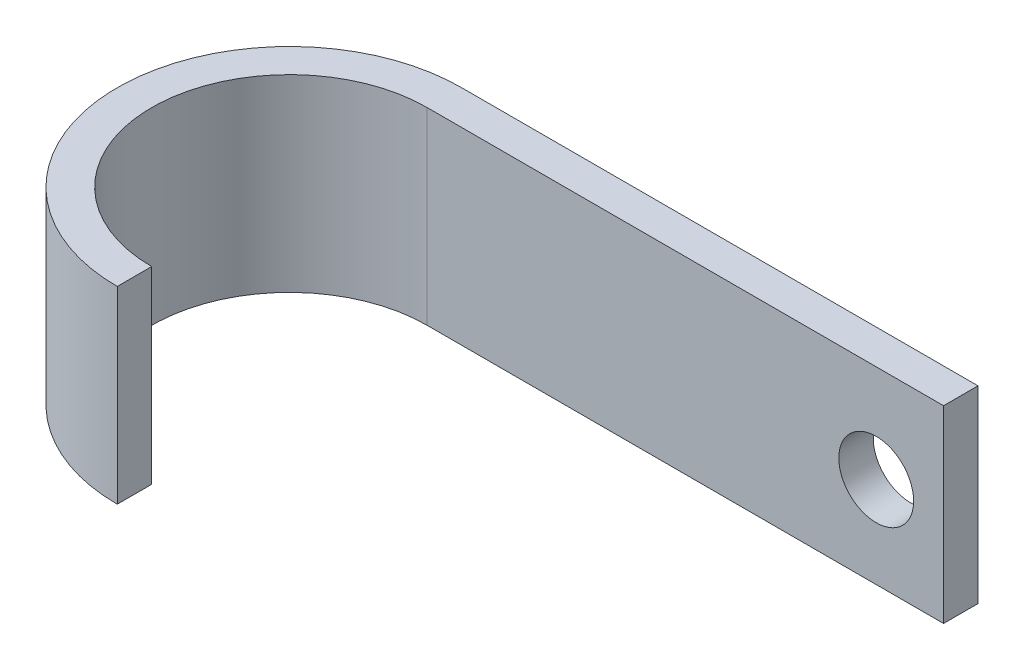
ISO-10303-21;
HEADER;
FILE_DESCRIPTION(('STEP AP214'),'2;1');
FILE_NAME('part.step','',(''),(''),'','','');
FILE_SCHEMA(('AUTOMOTIVE_DESIGN { 1 0 10303 214 1 1 1 1 }'));
ENDSEC;
DATA;
#1=APPLICATION_CONTEXT('core data for automotive mechanical design processes');
#2=APPLICATION_PROTOCOL_DEFINITION('international standard','automotive_design',2000,#1);
#3=PRODUCT_CONTEXT('',#1,'mechanical');
#4=PRODUCT('Part','Part','',(#3));
#5=PRODUCT_RELATED_PRODUCT_CATEGORY('part','',(#4));
#6=PRODUCT_DEFINITION_FORMATION('','',#4);
#7=PRODUCT_DEFINITION_CONTEXT('part definition',#1,'design');
#8=PRODUCT_DEFINITION('design','',#6,#7);
#9=PRODUCT_DEFINITION_SHAPE('','',#8);
#10=(LENGTH_UNIT() NAMED_UNIT(*) SI_UNIT(.MILLI.,.METRE.));
#11=(NAMED_UNIT(*) PLANE_ANGLE_UNIT() SI_UNIT($,.RADIAN.));
#12=(NAMED_UNIT(*) SI_UNIT($,.STERADIAN.) SOLID_ANGLE_UNIT());
#13=UNCERTAINTY_MEASURE_WITH_UNIT(LENGTH_MEASURE(1.E-05),#10,'distance_accuracy_value','');
#14=(GEOMETRIC_REPRESENTATION_CONTEXT(3) GLOBAL_UNCERTAINTY_ASSIGNED_CONTEXT((#13)) GLOBAL_UNIT_ASSIGNED_CONTEXT((#10,
#11,#12)) REPRESENTATION_CONTEXT('',''));
#15=CARTESIAN_POINT('',(0.,0.,0.));
#16=DIRECTION('',(0.,0.,1.));
#17=DIRECTION('',(1.,0.,0.));
#18=AXIS2_PLACEMENT_3D('',#15,#16,#17);
#19=CARTESIAN_POINT('',(0.,12.6,0.));
#20=DIRECTION('',(0.,-1.,0.));
#21=DIRECTION('',(0.,0.,-1.));
#22=AXIS2_PLACEMENT_3D('',#19,#20,#21);
#23=CYLINDRICAL_SURFACE('',#22,11.5);
#24=CARTESIAN_POINT('',(0.,0.,0.));
#25=DIRECTION('',(0.,1.,0.));
#26=DIRECTION('',(0.,0.,1.));
#27=AXIS2_PLACEMENT_3D('',#24,#25,#26);
#28=CIRCLE('',#27,11.5);
#29=CARTESIAN_POINT('',(0.,0.,-11.5));
#30=VERTEX_POINT('',#29);
#31=CARTESIAN_POINT('',(0.,0.,11.5));
#32=VERTEX_POINT('',#31);
#33=EDGE_CURVE('E119',#30,#32,#28,.T.);
#34=ORIENTED_EDGE('',*,*,#33,.T.);
#35=DIRECTION('',(0.,-1.,0.));
#36=VECTOR('',#35,1.);
#37=CARTESIAN_POINT('',(0.,12.6,11.5));
#38=LINE('',#37,#36);
#39=CARTESIAN_POINT('',(0.,12.6,11.5));
#40=VERTEX_POINT('',#39);
#41=EDGE_CURVE('E11',#40,#32,#38,.T.);
#42=ORIENTED_EDGE('',*,*,#41,.F.);
#43=CARTESIAN_POINT('',(0.,12.6,0.));
#44=DIRECTION('',(0.,1.,0.));
#45=DIRECTION('',(0.,0.,1.));
#46=AXIS2_PLACEMENT_3D('',#43,#44,#45);
#47=CIRCLE('',#46,11.5);
#48=CARTESIAN_POINT('',(0.,12.6,-11.5));
#49=VERTEX_POINT('',#48);
#50=EDGE_CURVE('E130',#49,#40,#47,.T.);
#51=ORIENTED_EDGE('',*,*,#50,.F.);
#52=DIRECTION('',(0.,-1.,0.));
#53=VECTOR('',#52,1.);
#54=CARTESIAN_POINT('',(0.,12.6,-11.5));
#55=LINE('',#54,#53);
#56=EDGE_CURVE('E115',#49,#30,#55,.T.);
#57=ORIENTED_EDGE('',*,*,#56,.T.);
#58=EDGE_LOOP('',(#34,#42,#51,#57));
#59=FACE_BOUND('',#58,.T.);
#60=ADVANCED_FACE('F33',(#59),#23,.T.);
#61=CARTESIAN_POINT('',(0.,12.6,11.5));
#62=DIRECTION('',(-1.,0.,0.));
#63=DIRECTION('',(0.,0.,1.));
#64=AXIS2_PLACEMENT_3D('',#61,#62,#63);
#65=PLANE('',#64);
#66=DIRECTION('',(0.,0.,-1.));
#67=VECTOR('',#66,1.);
#68=CARTESIAN_POINT('',(0.,0.,11.5));
#69=LINE('',#68,#67);
#70=CARTESIAN_POINT('',(0.,0.,9.2));
#71=VERTEX_POINT('',#70);
#72=EDGE_CURVE('E122',#32,#71,#69,.T.);
#73=ORIENTED_EDGE('',*,*,#72,.T.);
#74=DIRECTION('',(0.,-1.,0.));
#75=VECTOR('',#74,1.);
#76=CARTESIAN_POINT('',(0.,12.6,9.2));
#77=LINE('',#76,#75);
#78=CARTESIAN_POINT('',(0.,12.6,9.2));
#79=VERTEX_POINT('',#78);
#80=EDGE_CURVE('E42',#79,#71,#77,.T.);
#81=ORIENTED_EDGE('',*,*,#80,.F.);
#82=DIRECTION('',(0.,0.,-1.));
#83=VECTOR('',#82,1.);
#84=CARTESIAN_POINT('',(0.,12.6,11.5));
#85=LINE('',#84,#83);
#86=EDGE_CURVE('E85',#40,#79,#85,.T.);
#87=ORIENTED_EDGE('',*,*,#86,.F.);
#88=ORIENTED_EDGE('',*,*,#41,.T.);
#89=EDGE_LOOP('',(#73,#81,#87,#88));
#90=FACE_BOUND('',#89,.T.);
#91=ADVANCED_FACE('F163',(#90),#65,.F.);
#92=CARTESIAN_POINT('',(0.,12.6,0.));
#93=DIRECTION('',(0.,-1.,0.));
#94=DIRECTION('',(0.,0.,-1.));
#95=AXIS2_PLACEMENT_3D('',#92,#93,#94);
#96=CYLINDRICAL_SURFACE('',#95,9.2);
#97=CARTESIAN_POINT('',(0.,0.,0.));
#98=DIRECTION('',(0.,-1.,0.));
#99=DIRECTION('',(0.,0.,-1.));
#100=AXIS2_PLACEMENT_3D('',#97,#98,#99);
#101=CIRCLE('',#100,9.2);
#102=CARTESIAN_POINT('',(0.,0.,-9.19999999999999));
#103=VERTEX_POINT('',#102);
#104=EDGE_CURVE('E124',#71,#103,#101,.T.);
#105=ORIENTED_EDGE('',*,*,#104,.T.);
#106=DIRECTION('',(0.,-1.,0.));
#107=VECTOR('',#106,1.);
#108=CARTESIAN_POINT('',(0.,12.6,-9.19999999999999));
#109=LINE('',#108,#107);
#110=CARTESIAN_POINT('',(0.,12.6,-9.19999999999999));
#111=VERTEX_POINT('',#110);
#112=EDGE_CURVE('E110',#111,#103,#109,.T.);
#113=ORIENTED_EDGE('',*,*,#112,.F.);
#114=CARTESIAN_POINT('',(0.,12.6,0.));
#115=DIRECTION('',(0.,-1.,0.));
#116=DIRECTION('',(0.,0.,-1.));
#117=AXIS2_PLACEMENT_3D('',#114,#115,#116);
#118=CIRCLE('',#117,9.2);
#119=EDGE_CURVE('E99',#79,#111,#118,.T.);
#120=ORIENTED_EDGE('',*,*,#119,.F.);
#121=ORIENTED_EDGE('',*,*,#80,.T.);
#122=EDGE_LOOP('',(#105,#113,#120,#121));
#123=FACE_BOUND('',#122,.T.);
#124=ADVANCED_FACE('F137',(#123),#96,.F.);
#125=CARTESIAN_POINT('',(34.5,12.6,-9.2));
#126=DIRECTION('',(0.,0.,-1.));
#127=DIRECTION('',(-1.,0.,0.));
#128=AXIS2_PLACEMENT_3D('',#125,#126,#127);
#129=PLANE('',#128);
#130=CARTESIAN_POINT('',(30.,6.07998962858584,-9.19999999999999));
#131=DIRECTION('',(0.,0.,1.));
#132=DIRECTION('',(1.,0.,0.));
#133=AXIS2_PLACEMENT_3D('',#130,#131,#132);
#134=CIRCLE('',#133,2.5);
#135=CARTESIAN_POINT('',(32.5,6.07998962858584,-9.19999999999999));
#136=VERTEX_POINT('',#135);
#137=EDGE_CURVE('E146',#136,#136,#134,.T.);
#138=ORIENTED_EDGE('',*,*,#137,.F.);
#139=EDGE_LOOP('',(#138));
#140=FACE_BOUND('',#139,.T.);
#141=DIRECTION('',(1.,0.,0.));
#142=VECTOR('',#141,1.);
#143=CARTESIAN_POINT('',(34.5,0.,-9.2));
#144=LINE('',#143,#142);
#145=CARTESIAN_POINT('',(34.5,0.,-9.2));
#146=VERTEX_POINT('',#145);
#147=EDGE_CURVE('E108',#103,#146,#144,.T.);
#148=ORIENTED_EDGE('',*,*,#147,.T.);
#149=DIRECTION('',(0.,-1.,0.));
#150=VECTOR('',#149,1.);
#151=CARTESIAN_POINT('',(34.5,12.6,-9.2));
#152=LINE('',#151,#150);
#153=CARTESIAN_POINT('',(34.5,12.6,-9.2));
#154=VERTEX_POINT('',#153);
#155=EDGE_CURVE('E105',#154,#146,#152,.T.);
#156=ORIENTED_EDGE('',*,*,#155,.F.);
#157=DIRECTION('',(1.,0.,0.));
#158=VECTOR('',#157,1.);
#159=CARTESIAN_POINT('',(34.5,12.6,-9.2));
#160=LINE('',#159,#158);
#161=EDGE_CURVE('E92',#111,#154,#160,.T.);
#162=ORIENTED_EDGE('',*,*,#161,.F.);
#163=ORIENTED_EDGE('',*,*,#112,.T.);
#164=EDGE_LOOP('',(#148,#156,#162,#163));
#165=FACE_BOUND('',#164,.T.);
#166=ADVANCED_FACE('F106',(#140,#165),#129,.F.);
#167=CARTESIAN_POINT('',(34.5,12.6,-11.5));
#168=DIRECTION('',(-1.,0.,0.));
#169=DIRECTION('',(0.,0.,1.));
#170=AXIS2_PLACEMENT_3D('',#167,#168,#169);
#171=PLANE('',#170);
#172=DIRECTION('',(0.,0.,-1.));
#173=VECTOR('',#172,1.);
#174=CARTESIAN_POINT('',(34.5,0.,-11.5));
#175=LINE('',#174,#173);
#176=CARTESIAN_POINT('',(34.5,0.,-11.5));
#177=VERTEX_POINT('',#176);
#178=EDGE_CURVE('E127',#146,#177,#175,.T.);
#179=ORIENTED_EDGE('',*,*,#178,.T.);
#180=DIRECTION('',(0.,-1.,0.));
#181=VECTOR('',#180,1.);
#182=CARTESIAN_POINT('',(34.5,12.6,-11.5));
#183=LINE('',#182,#181);
#184=CARTESIAN_POINT('',(34.5,12.6,-11.5));
#185=VERTEX_POINT('',#184);
#186=EDGE_CURVE('E111',#185,#177,#183,.T.);
#187=ORIENTED_EDGE('',*,*,#186,.F.);
#188=DIRECTION('',(0.,0.,-1.));
#189=VECTOR('',#188,1.);
#190=CARTESIAN_POINT('',(34.5,12.6,-11.5));
#191=LINE('',#190,#189);
#192=EDGE_CURVE('E96',#154,#185,#191,.T.);
#193=ORIENTED_EDGE('',*,*,#192,.F.);
#194=ORIENTED_EDGE('',*,*,#155,.T.);
#195=EDGE_LOOP('',(#179,#187,#193,#194));
#196=FACE_BOUND('',#195,.T.);
#197=ADVANCED_FACE('F113',(#196),#171,.F.);
#198=CARTESIAN_POINT('',(0.,12.6,-11.5));
#199=DIRECTION('',(0.,0.,1.));
#200=DIRECTION('',(1.,0.,0.));
#201=AXIS2_PLACEMENT_3D('',#198,#199,#200);
#202=PLANE('',#201);
#203=CARTESIAN_POINT('',(30.,6.07998962858584,-11.5));
#204=DIRECTION('',(0.,0.,1.));
#205=DIRECTION('',(1.,0.,0.));
#206=AXIS2_PLACEMENT_3D('',#203,#204,#205);
#207=CIRCLE('',#206,2.5);
#208=CARTESIAN_POINT('',(32.5,6.07998962858584,-11.5));
#209=VERTEX_POINT('',#208);
#210=EDGE_CURVE('E36',#209,#209,#207,.T.);
#211=ORIENTED_EDGE('',*,*,#210,.T.);
#212=EDGE_LOOP('',(#211));
#213=FACE_BOUND('',#212,.T.);
#214=DIRECTION('',(-1.,0.,0.));
#215=VECTOR('',#214,1.);
#216=CARTESIAN_POINT('',(0.,0.,-11.5));
#217=LINE('',#216,#215);
#218=EDGE_CURVE('E73',#177,#30,#217,.T.);
#219=ORIENTED_EDGE('',*,*,#218,.T.);
#220=ORIENTED_EDGE('',*,*,#56,.F.);
#221=DIRECTION('',(-1.,0.,0.));
#222=VECTOR('',#221,1.);
#223=CARTESIAN_POINT('',(11.5,12.6,-11.5));
#224=LINE('',#223,#222);
#225=EDGE_CURVE('E50',#185,#49,#224,.T.);
#226=ORIENTED_EDGE('',*,*,#225,.F.);
#227=ORIENTED_EDGE('',*,*,#186,.T.);
#228=EDGE_LOOP('',(#219,#220,#226,#227));
#229=FACE_BOUND('',#228,.T.);
#230=ADVANCED_FACE('F139',(#213,#229),#202,.F.);
#231=CARTESIAN_POINT('',(0.,12.6,0.));
#232=DIRECTION('',(0.,1.,0.));
#233=DIRECTION('',(0.,0.,1.));
#234=AXIS2_PLACEMENT_3D('',#231,#232,#233);
#235=PLANE('',#234);
#236=ORIENTED_EDGE('',*,*,#50,.T.);
#237=ORIENTED_EDGE('',*,*,#86,.T.);
#238=ORIENTED_EDGE('',*,*,#119,.T.);
#239=ORIENTED_EDGE('',*,*,#161,.T.);
#240=ORIENTED_EDGE('',*,*,#192,.T.);
#241=ORIENTED_EDGE('',*,*,#225,.T.);
#242=EDGE_LOOP('',(#236,#237,#238,#239,#240,#241));
#243=FACE_BOUND('',#242,.T.);
#244=ADVANCED_FACE('F94',(#243),#235,.T.);
#245=CARTESIAN_POINT('',(0.,0.,0.));
#246=DIRECTION('',(0.,1.,0.));
#247=DIRECTION('',(0.,0.,1.));
#248=AXIS2_PLACEMENT_3D('',#245,#246,#247);
#249=PLANE('',#248);
#250=ORIENTED_EDGE('',*,*,#33,.F.);
#251=ORIENTED_EDGE('',*,*,#218,.F.);
#252=ORIENTED_EDGE('',*,*,#178,.F.);
#253=ORIENTED_EDGE('',*,*,#147,.F.);
#254=ORIENTED_EDGE('',*,*,#104,.F.);
#255=ORIENTED_EDGE('',*,*,#72,.F.);
#256=EDGE_LOOP('',(#250,#251,#252,#253,#254,#255));
#257=FACE_BOUND('',#256,.T.);
#258=ADVANCED_FACE('F138',(#257),#249,.F.);
#259=CARTESIAN_POINT('',(30.,6.07998962858584,-21.8));
#260=DIRECTION('',(0.,0.,1.));
#261=DIRECTION('',(1.,0.,0.));
#262=AXIS2_PLACEMENT_3D('',#259,#260,#261);
#263=CYLINDRICAL_SURFACE('',#262,2.5);
#264=ORIENTED_EDGE('',*,*,#137,.T.);
#265=EDGE_LOOP('',(#264));
#266=FACE_BOUND('',#265,.T.);
#267=ORIENTED_EDGE('',*,*,#210,.F.);
#268=EDGE_LOOP('',(#267));
#269=FACE_BOUND('',#268,.T.);
#270=ADVANCED_FACE('F154',(#266,#269),#263,.F.);
#271=CLOSED_SHELL('',(#60,#91,#124,#166,#197,#230,#244,#258,#270));
#272=MANIFOLD_SOLID_BREP('B2',#271);
#273=ADVANCED_BREP_SHAPE_REPRESENTATION('',(#18,#272),#14);
#274=SHAPE_DEFINITION_REPRESENTATION(#9,#273);
ENDSEC;
END-ISO-10303-21;
